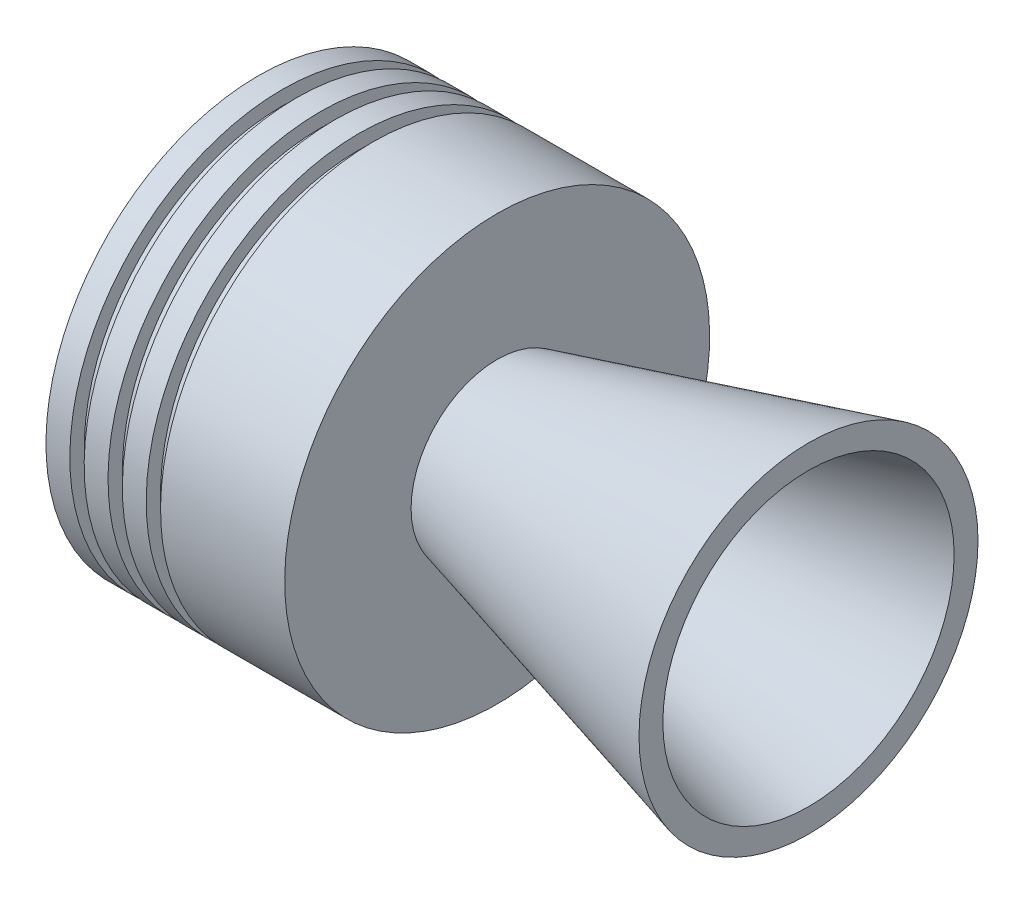
ISO-10303-21;
HEADER;
FILE_DESCRIPTION(('STEP AP214'),'2;1');
FILE_NAME('part.step','',(''),(''),'','','');
FILE_SCHEMA(('AUTOMOTIVE_DESIGN { 1 0 10303 214 1 1 1 1 }'));
ENDSEC;
DATA;
#1=APPLICATION_CONTEXT('core data for automotive mechanical design processes');
#2=APPLICATION_PROTOCOL_DEFINITION('international standard','automotive_design',2000,#1);
#3=PRODUCT_CONTEXT('',#1,'mechanical');
#4=PRODUCT('Part','Part','',(#3));
#5=PRODUCT_RELATED_PRODUCT_CATEGORY('part','',(#4));
#6=PRODUCT_DEFINITION_FORMATION('','',#4);
#7=PRODUCT_DEFINITION_CONTEXT('part definition',#1,'design');
#8=PRODUCT_DEFINITION('design','',#6,#7);
#9=PRODUCT_DEFINITION_SHAPE('','',#8);
#10=(LENGTH_UNIT() NAMED_UNIT(*) SI_UNIT(.MILLI.,.METRE.));
#11=(NAMED_UNIT(*) PLANE_ANGLE_UNIT() SI_UNIT($,.RADIAN.));
#12=(NAMED_UNIT(*) SI_UNIT($,.STERADIAN.) SOLID_ANGLE_UNIT());
#13=UNCERTAINTY_MEASURE_WITH_UNIT(LENGTH_MEASURE(1.E-05),#10,'distance_accuracy_value','');
#14=(GEOMETRIC_REPRESENTATION_CONTEXT(3) GLOBAL_UNCERTAINTY_ASSIGNED_CONTEXT((#13)) GLOBAL_UNIT_ASSIGNED_CONTEXT((#10,
#11,#12)) REPRESENTATION_CONTEXT('',''));
#15=CARTESIAN_POINT('',(0.,0.,0.));
#16=DIRECTION('',(0.,0.,1.));
#17=DIRECTION('',(1.,0.,0.));
#18=AXIS2_PLACEMENT_3D('',#15,#16,#17);
#19=CARTESIAN_POINT('',(0.,0.,0.));
#20=DIRECTION('',(1.,0.,0.));
#21=DIRECTION('',(0.,1.,0.));
#22=AXIS2_PLACEMENT_3D('',#19,#20,#21);
#23=CYLINDRICAL_SURFACE('',#22,11.5);
#24=CARTESIAN_POINT('',(-82.1051177665174,0.,0.));
#25=DIRECTION('',(1.,0.,0.));
#26=DIRECTION('',(0.,1.,0.));
#27=AXIS2_PLACEMENT_3D('',#24,#25,#26);
#28=CIRCLE('',#27,11.5);
#29=CARTESIAN_POINT('',(-82.1051177665174,11.5,0.));
#30=VERTEX_POINT('',#29);
#31=EDGE_CURVE('E112',#30,#30,#28,.T.);
#32=ORIENTED_EDGE('',*,*,#31,.T.);
#33=EDGE_LOOP('',(#32));
#34=FACE_BOUND('',#33,.T.);
#35=CARTESIAN_POINT('',(-83.1051177665174,0.,0.));
#36=DIRECTION('',(1.,0.,0.));
#37=DIRECTION('',(0.,1.,0.));
#38=AXIS2_PLACEMENT_3D('',#35,#36,#37);
#39=CIRCLE('',#38,11.5);
#40=CARTESIAN_POINT('',(-83.1051177665174,11.5,0.));
#41=VERTEX_POINT('',#40);
#42=EDGE_CURVE('E10',#41,#41,#39,.T.);
#43=ORIENTED_EDGE('',*,*,#42,.F.);
#44=EDGE_LOOP('',(#43));
#45=FACE_BOUND('',#44,.T.);
#46=ADVANCED_FACE('F36',(#34,#45),#23,.F.);
#47=CARTESIAN_POINT('',(-126.4,0.,0.));
#48=DIRECTION('',(-1.,0.,0.));
#49=DIRECTION('',(0.,-1.,0.));
#50=AXIS2_PLACEMENT_3D('',#47,#48,#49);
#51=CONICAL_SURFACE('',#50,36.4963119120344,0.5235987755983);
#52=ORIENTED_EDGE('',*,*,#42,.T.);
#53=EDGE_LOOP('',(#52));
#54=FACE_BOUND('',#53,.T.);
#55=CARTESIAN_POINT('',(-126.4,0.,0.));
#56=DIRECTION('',(1.,0.,0.));
#57=DIRECTION('',(0.,1.,0.));
#58=AXIS2_PLACEMENT_3D('',#55,#56,#57);
#59=CIRCLE('',#58,36.4963119120344);
#60=CARTESIAN_POINT('',(-126.4,36.4963119120344,0.));
#61=VERTEX_POINT('',#60);
#62=EDGE_CURVE('E44',#61,#61,#59,.T.);
#63=ORIENTED_EDGE('',*,*,#62,.F.);
#64=EDGE_LOOP('',(#63));
#65=FACE_BOUND('',#64,.T.);
#66=ADVANCED_FACE('F138',(#54,#65),#51,.F.);
#67=CARTESIAN_POINT('',(-126.4,36.4963119120344,0.));
#68=DIRECTION('',(-1.,0.,0.));
#69=DIRECTION('',(0.,-1.,0.));
#70=AXIS2_PLACEMENT_3D('',#67,#68,#69);
#71=PLANE('',#70);
#72=ORIENTED_EDGE('',*,*,#62,.T.);
#73=EDGE_LOOP('',(#72));
#74=FACE_BOUND('',#73,.T.);
#75=CARTESIAN_POINT('',(-126.4,0.,0.));
#76=DIRECTION('',(1.,0.,0.));
#77=DIRECTION('',(0.,1.,0.));
#78=AXIS2_PLACEMENT_3D('',#75,#76,#77);
#79=CIRCLE('',#78,44.4963119120344);
#80=CARTESIAN_POINT('',(-126.4,44.4963119120344,0.));
#81=VERTEX_POINT('',#80);
#82=EDGE_CURVE('E50',#81,#81,#79,.T.);
#83=ORIENTED_EDGE('',*,*,#82,.F.);
#84=EDGE_LOOP('',(#83));
#85=FACE_BOUND('',#84,.T.);
#86=ADVANCED_FACE('F142',(#74,#85),#71,.T.);
#87=CARTESIAN_POINT('',(0.,0.,0.));
#88=DIRECTION('',(1.,0.,0.));
#89=DIRECTION('',(0.,1.,0.));
#90=AXIS2_PLACEMENT_3D('',#87,#88,#89);
#91=CYLINDRICAL_SURFACE('',#90,44.4963119120344);
#92=ORIENTED_EDGE('',*,*,#82,.T.);
#93=EDGE_LOOP('',(#92));
#94=FACE_BOUND('',#93,.T.);
#95=CARTESIAN_POINT('',(-121.4,0.,0.));
#96=DIRECTION('',(1.,0.,0.));
#97=DIRECTION('',(0.,1.,0.));
#98=AXIS2_PLACEMENT_3D('',#95,#96,#97);
#99=CIRCLE('',#98,44.4963119120344);
#100=CARTESIAN_POINT('',(-121.4,44.4963119120344,0.));
#101=VERTEX_POINT('',#100);
#102=EDGE_CURVE('E56',#101,#101,#99,.T.);
#103=ORIENTED_EDGE('',*,*,#102,.F.);
#104=EDGE_LOOP('',(#103));
#105=FACE_BOUND('',#104,.T.);
#106=ADVANCED_FACE('F146',(#94,#105),#91,.T.);
#107=CARTESIAN_POINT('',(-121.4,44.4963119120344,0.));
#108=DIRECTION('',(1.,0.,0.));
#109=DIRECTION('',(0.,1.,0.));
#110=AXIS2_PLACEMENT_3D('',#107,#108,#109);
#111=PLANE('',#110);
#112=ORIENTED_EDGE('',*,*,#102,.T.);
#113=EDGE_LOOP('',(#112));
#114=FACE_BOUND('',#113,.T.);
#115=CARTESIAN_POINT('',(-121.4,0.,0.));
#116=DIRECTION('',(1.,0.,0.));
#117=DIRECTION('',(0.,1.,0.));
#118=AXIS2_PLACEMENT_3D('',#115,#116,#117);
#119=CIRCLE('',#118,41.4963119120344);
#120=CARTESIAN_POINT('',(-121.4,41.4963119120344,0.));
#121=VERTEX_POINT('',#120);
#122=EDGE_CURVE('E60',#121,#121,#119,.T.);
#123=ORIENTED_EDGE('',*,*,#122,.F.);
#124=EDGE_LOOP('',(#123));
#125=FACE_BOUND('',#124,.T.);
#126=ADVANCED_FACE('F153',(#114,#125),#111,.T.);
#127=CARTESIAN_POINT('',(0.,0.,0.));
#128=DIRECTION('',(1.,0.,0.));
#129=DIRECTION('',(0.,1.,0.));
#130=AXIS2_PLACEMENT_3D('',#127,#128,#129);
#131=CYLINDRICAL_SURFACE('',#130,41.4963119120344);
#132=ORIENTED_EDGE('',*,*,#122,.T.);
#133=EDGE_LOOP('',(#132));
#134=FACE_BOUND('',#133,.T.);
#135=CARTESIAN_POINT('',(-118.4,0.,0.));
#136=DIRECTION('',(1.,0.,0.));
#137=DIRECTION('',(0.,1.,0.));
#138=AXIS2_PLACEMENT_3D('',#135,#136,#137);
#139=CIRCLE('',#138,41.4963119120344);
#140=CARTESIAN_POINT('',(-118.4,41.4963119120344,0.));
#141=VERTEX_POINT('',#140);
#142=EDGE_CURVE('E64',#141,#141,#139,.T.);
#143=ORIENTED_EDGE('',*,*,#142,.F.);
#144=EDGE_LOOP('',(#143));
#145=FACE_BOUND('',#144,.T.);
#146=ADVANCED_FACE('F157',(#134,#145),#131,.T.);
#147=CARTESIAN_POINT('',(-118.4,41.4963119120344,0.));
#148=DIRECTION('',(-1.,0.,0.));
#149=DIRECTION('',(0.,-1.,0.));
#150=AXIS2_PLACEMENT_3D('',#147,#148,#149);
#151=PLANE('',#150);
#152=ORIENTED_EDGE('',*,*,#142,.T.);
#153=EDGE_LOOP('',(#152));
#154=FACE_BOUND('',#153,.T.);
#155=CARTESIAN_POINT('',(-118.4,0.,0.));
#156=DIRECTION('',(1.,0.,0.));
#157=DIRECTION('',(0.,1.,0.));
#158=AXIS2_PLACEMENT_3D('',#155,#156,#157);
#159=CIRCLE('',#158,44.4963119120344);
#160=CARTESIAN_POINT('',(-118.4,44.4963119120344,0.));
#161=VERTEX_POINT('',#160);
#162=EDGE_CURVE('E68',#161,#161,#159,.T.);
#163=ORIENTED_EDGE('',*,*,#162,.F.);
#164=EDGE_LOOP('',(#163));
#165=FACE_BOUND('',#164,.T.);
#166=ADVANCED_FACE('F161',(#154,#165),#151,.T.);
#167=CARTESIAN_POINT('',(0.,0.,0.));
#168=DIRECTION('',(1.,0.,0.));
#169=DIRECTION('',(0.,1.,0.));
#170=AXIS2_PLACEMENT_3D('',#167,#168,#169);
#171=CYLINDRICAL_SURFACE('',#170,44.4963119120344);
#172=ORIENTED_EDGE('',*,*,#162,.T.);
#173=EDGE_LOOP('',(#172));
#174=FACE_BOUND('',#173,.T.);
#175=CARTESIAN_POINT('',(-113.4,0.,0.));
#176=DIRECTION('',(1.,0.,0.));
#177=DIRECTION('',(0.,1.,0.));
#178=AXIS2_PLACEMENT_3D('',#175,#176,#177);
#179=CIRCLE('',#178,44.4963119120344);
#180=CARTESIAN_POINT('',(-113.4,44.4963119120344,0.));
#181=VERTEX_POINT('',#180);
#182=EDGE_CURVE('E72',#181,#181,#179,.T.);
#183=ORIENTED_EDGE('',*,*,#182,.F.);
#184=EDGE_LOOP('',(#183));
#185=FACE_BOUND('',#184,.T.);
#186=ADVANCED_FACE('F165',(#174,#185),#171,.T.);
#187=CARTESIAN_POINT('',(-113.4,44.4963119120344,0.));
#188=DIRECTION('',(1.,0.,0.));
#189=DIRECTION('',(0.,1.,0.));
#190=AXIS2_PLACEMENT_3D('',#187,#188,#189);
#191=PLANE('',#190);
#192=ORIENTED_EDGE('',*,*,#182,.T.);
#193=EDGE_LOOP('',(#192));
#194=FACE_BOUND('',#193,.T.);
#195=CARTESIAN_POINT('',(-113.4,0.,0.));
#196=DIRECTION('',(1.,0.,0.));
#197=DIRECTION('',(0.,1.,0.));
#198=AXIS2_PLACEMENT_3D('',#195,#196,#197);
#199=CIRCLE('',#198,41.4963119120344);
#200=CARTESIAN_POINT('',(-113.4,41.4963119120344,0.));
#201=VERTEX_POINT('',#200);
#202=EDGE_CURVE('E76',#201,#201,#199,.T.);
#203=ORIENTED_EDGE('',*,*,#202,.F.);
#204=EDGE_LOOP('',(#203));
#205=FACE_BOUND('',#204,.T.);
#206=ADVANCED_FACE('F169',(#194,#205),#191,.T.);
#207=CARTESIAN_POINT('',(0.,0.,0.));
#208=DIRECTION('',(1.,0.,0.));
#209=DIRECTION('',(0.,1.,0.));
#210=AXIS2_PLACEMENT_3D('',#207,#208,#209);
#211=CYLINDRICAL_SURFACE('',#210,41.4963119120344);
#212=ORIENTED_EDGE('',*,*,#202,.T.);
#213=EDGE_LOOP('',(#212));
#214=FACE_BOUND('',#213,.T.);
#215=CARTESIAN_POINT('',(-110.4,0.,0.));
#216=DIRECTION('',(1.,0.,0.));
#217=DIRECTION('',(0.,1.,0.));
#218=AXIS2_PLACEMENT_3D('',#215,#216,#217);
#219=CIRCLE('',#218,41.4963119120344);
#220=CARTESIAN_POINT('',(-110.4,41.4963119120344,0.));
#221=VERTEX_POINT('',#220);
#222=EDGE_CURVE('E80',#221,#221,#219,.T.);
#223=ORIENTED_EDGE('',*,*,#222,.F.);
#224=EDGE_LOOP('',(#223));
#225=FACE_BOUND('',#224,.T.);
#226=ADVANCED_FACE('F173',(#214,#225),#211,.T.);
#227=CARTESIAN_POINT('',(-110.4,41.4963119120344,0.));
#228=DIRECTION('',(-1.,0.,0.));
#229=DIRECTION('',(0.,-1.,0.));
#230=AXIS2_PLACEMENT_3D('',#227,#228,#229);
#231=PLANE('',#230);
#232=ORIENTED_EDGE('',*,*,#222,.T.);
#233=EDGE_LOOP('',(#232));
#234=FACE_BOUND('',#233,.T.);
#235=CARTESIAN_POINT('',(-110.4,0.,0.));
#236=DIRECTION('',(1.,0.,0.));
#237=DIRECTION('',(0.,1.,0.));
#238=AXIS2_PLACEMENT_3D('',#235,#236,#237);
#239=CIRCLE('',#238,44.4963119120344);
#240=CARTESIAN_POINT('',(-110.4,44.4963119120344,0.));
#241=VERTEX_POINT('',#240);
#242=EDGE_CURVE('E84',#241,#241,#239,.T.);
#243=ORIENTED_EDGE('',*,*,#242,.F.);
#244=EDGE_LOOP('',(#243));
#245=FACE_BOUND('',#244,.T.);
#246=ADVANCED_FACE('F177',(#234,#245),#231,.T.);
#247=CARTESIAN_POINT('',(0.,0.,0.));
#248=DIRECTION('',(1.,0.,0.));
#249=DIRECTION('',(0.,1.,0.));
#250=AXIS2_PLACEMENT_3D('',#247,#248,#249);
#251=CYLINDRICAL_SURFACE('',#250,44.4963119120344);
#252=ORIENTED_EDGE('',*,*,#242,.T.);
#253=EDGE_LOOP('',(#252));
#254=FACE_BOUND('',#253,.T.);
#255=CARTESIAN_POINT('',(-105.4,0.,0.));
#256=DIRECTION('',(1.,0.,0.));
#257=DIRECTION('',(0.,1.,0.));
#258=AXIS2_PLACEMENT_3D('',#255,#256,#257);
#259=CIRCLE('',#258,44.4963119120344);
#260=CARTESIAN_POINT('',(-105.4,44.4963119120344,0.));
#261=VERTEX_POINT('',#260);
#262=EDGE_CURVE('E88',#261,#261,#259,.T.);
#263=ORIENTED_EDGE('',*,*,#262,.F.);
#264=EDGE_LOOP('',(#263));
#265=FACE_BOUND('',#264,.T.);
#266=ADVANCED_FACE('F181',(#254,#265),#251,.T.);
#267=CARTESIAN_POINT('',(-105.4,44.4963119120344,0.));
#268=DIRECTION('',(1.,0.,0.));
#269=DIRECTION('',(0.,1.,0.));
#270=AXIS2_PLACEMENT_3D('',#267,#268,#269);
#271=PLANE('',#270);
#272=ORIENTED_EDGE('',*,*,#262,.T.);
#273=EDGE_LOOP('',(#272));
#274=FACE_BOUND('',#273,.T.);
#275=CARTESIAN_POINT('',(-105.4,0.,0.));
#276=DIRECTION('',(1.,0.,0.));
#277=DIRECTION('',(0.,1.,0.));
#278=AXIS2_PLACEMENT_3D('',#275,#276,#277);
#279=CIRCLE('',#278,41.4963119120344);
#280=CARTESIAN_POINT('',(-105.4,41.4963119120344,0.));
#281=VERTEX_POINT('',#280);
#282=EDGE_CURVE('E92',#281,#281,#279,.T.);
#283=ORIENTED_EDGE('',*,*,#282,.F.);
#284=EDGE_LOOP('',(#283));
#285=FACE_BOUND('',#284,.T.);
#286=ADVANCED_FACE('F185',(#274,#285),#271,.T.);
#287=CARTESIAN_POINT('',(0.,0.,0.));
#288=DIRECTION('',(1.,0.,0.));
#289=DIRECTION('',(0.,1.,0.));
#290=AXIS2_PLACEMENT_3D('',#287,#288,#289);
#291=CYLINDRICAL_SURFACE('',#290,41.4963119120344);
#292=ORIENTED_EDGE('',*,*,#282,.T.);
#293=EDGE_LOOP('',(#292));
#294=FACE_BOUND('',#293,.T.);
#295=CARTESIAN_POINT('',(-102.4,0.,0.));
#296=DIRECTION('',(1.,0.,0.));
#297=DIRECTION('',(0.,1.,0.));
#298=AXIS2_PLACEMENT_3D('',#295,#296,#297);
#299=CIRCLE('',#298,41.4963119120344);
#300=CARTESIAN_POINT('',(-102.4,41.4963119120344,0.));
#301=VERTEX_POINT('',#300);
#302=EDGE_CURVE('E96',#301,#301,#299,.T.);
#303=ORIENTED_EDGE('',*,*,#302,.F.);
#304=EDGE_LOOP('',(#303));
#305=FACE_BOUND('',#304,.T.);
#306=ADVANCED_FACE('F189',(#294,#305),#291,.T.);
#307=CARTESIAN_POINT('',(-102.4,41.4963119120344,0.));
#308=DIRECTION('',(-1.,0.,0.));
#309=DIRECTION('',(0.,-1.,0.));
#310=AXIS2_PLACEMENT_3D('',#307,#308,#309);
#311=PLANE('',#310);
#312=ORIENTED_EDGE('',*,*,#302,.T.);
#313=EDGE_LOOP('',(#312));
#314=FACE_BOUND('',#313,.T.);
#315=CARTESIAN_POINT('',(-102.4,0.,0.));
#316=DIRECTION('',(1.,0.,0.));
#317=DIRECTION('',(0.,1.,0.));
#318=AXIS2_PLACEMENT_3D('',#315,#316,#317);
#319=CIRCLE('',#318,44.4963119120344);
#320=CARTESIAN_POINT('',(-102.4,44.4963119120344,0.));
#321=VERTEX_POINT('',#320);
#322=EDGE_CURVE('E100',#321,#321,#319,.T.);
#323=ORIENTED_EDGE('',*,*,#322,.F.);
#324=EDGE_LOOP('',(#323));
#325=FACE_BOUND('',#324,.T.);
#326=ADVANCED_FACE('F193',(#314,#325),#311,.T.);
#327=CARTESIAN_POINT('',(0.,0.,0.));
#328=DIRECTION('',(1.,0.,0.));
#329=DIRECTION('',(0.,1.,0.));
#330=AXIS2_PLACEMENT_3D('',#327,#328,#329);
#331=CYLINDRICAL_SURFACE('',#330,44.4963119120344);
#332=ORIENTED_EDGE('',*,*,#322,.T.);
#333=EDGE_LOOP('',(#332));
#334=FACE_BOUND('',#333,.T.);
#335=CARTESIAN_POINT('',(-76.4,0.,0.));
#336=DIRECTION('',(1.,0.,0.));
#337=DIRECTION('',(0.,1.,0.));
#338=AXIS2_PLACEMENT_3D('',#335,#336,#337);
#339=CIRCLE('',#338,44.4963119120344);
#340=CARTESIAN_POINT('',(-76.4,44.4963119120344,0.));
#341=VERTEX_POINT('',#340);
#342=EDGE_CURVE('E104',#341,#341,#339,.T.);
#343=ORIENTED_EDGE('',*,*,#342,.F.);
#344=EDGE_LOOP('',(#343));
#345=FACE_BOUND('',#344,.T.);
#346=ADVANCED_FACE('F197',(#334,#345),#331,.T.);
#347=CARTESIAN_POINT('',(-76.4,44.4963119120344,0.));
#348=DIRECTION('',(1.,0.,0.));
#349=DIRECTION('',(0.,1.,0.));
#350=AXIS2_PLACEMENT_3D('',#347,#348,#349);
#351=PLANE('',#350);
#352=ORIENTED_EDGE('',*,*,#342,.T.);
#353=EDGE_LOOP('',(#352));
#354=FACE_BOUND('',#353,.T.);
#355=CARTESIAN_POINT('',(-76.4,0.,0.));
#356=DIRECTION('',(1.,0.,0.));
#357=DIRECTION('',(0.,1.,0.));
#358=AXIS2_PLACEMENT_3D('',#355,#356,#357);
#359=CIRCLE('',#358,18.0286816982628);
#360=CARTESIAN_POINT('',(-76.4,18.0286816982628,0.));
#361=VERTEX_POINT('',#360);
#362=EDGE_CURVE('E108',#361,#361,#359,.T.);
#363=ORIENTED_EDGE('',*,*,#362,.F.);
#364=EDGE_LOOP('',(#363));
#365=FACE_BOUND('',#364,.T.);
#366=ADVANCED_FACE('F201',(#354,#365),#351,.T.);
#367=CARTESIAN_POINT('',(0.,0.,0.));
#368=DIRECTION('',(1.,0.,0.));
#369=DIRECTION('',(0.,1.,0.));
#370=AXIS2_PLACEMENT_3D('',#367,#368,#369);
#371=CONICAL_SURFACE('',#370,38.5,0.261799387799143);
#372=CARTESIAN_POINT('',(-11.1961524227069,0.,0.));
#373=DIRECTION('',(-1.,0.,0.));
#374=DIRECTION('',(0.,-1.,0.));
#375=AXIS2_PLACEMENT_3D('',#372,#373,#374);
#376=CIRCLE('',#375,35.5);
#377=CARTESIAN_POINT('',(-11.1961524227069,-35.5,0.));
#378=VERTEX_POINT('',#377);
#379=EDGE_CURVE('E116',#378,#378,#376,.F.);
#380=ORIENTED_EDGE('',*,*,#379,.F.);
#381=EDGE_LOOP('',(#380));
#382=FACE_BOUND('',#381,.T.);
#383=ORIENTED_EDGE('',*,*,#362,.T.);
#384=EDGE_LOOP('',(#383));
#385=FACE_BOUND('',#384,.T.);
#386=ADVANCED_FACE('F132',(#382,#385),#371,.T.);
#387=CARTESIAN_POINT('',(-82.1051177665174,0.,0.));
#388=DIRECTION('',(1.,0.,0.));
#389=DIRECTION('',(0.,1.,0.));
#390=AXIS2_PLACEMENT_3D('',#387,#388,#389);
#391=CONICAL_SURFACE('',#390,11.5,0.261799387799143);
#392=CARTESIAN_POINT('',(-11.1961524227069,0.,0.));
#393=DIRECTION('',(-1.,0.,0.));
#394=DIRECTION('',(0.,-1.,0.));
#395=AXIS2_PLACEMENT_3D('',#392,#393,#394);
#396=CIRCLE('',#395,30.5);
#397=CARTESIAN_POINT('',(-11.1961524227069,-30.5,0.));
#398=VERTEX_POINT('',#397);
#399=EDGE_CURVE('E39',#398,#398,#396,.T.);
#400=ORIENTED_EDGE('',*,*,#399,.F.);
#401=EDGE_LOOP('',(#400));
#402=FACE_BOUND('',#401,.T.);
#403=ORIENTED_EDGE('',*,*,#31,.F.);
#404=EDGE_LOOP('',(#403));
#405=FACE_BOUND('',#404,.T.);
#406=ADVANCED_FACE('F129',(#402,#405),#391,.F.);
#407=CARTESIAN_POINT('',(-11.1961524227069,35.5,0.));
#408=DIRECTION('',(-1.,0.,0.));
#409=DIRECTION('',(0.,-1.,0.));
#410=AXIS2_PLACEMENT_3D('',#407,#408,#409);
#411=PLANE('',#410);
#412=ORIENTED_EDGE('',*,*,#379,.T.);
#413=EDGE_LOOP('',(#412));
#414=FACE_BOUND('',#413,.T.);
#415=ORIENTED_EDGE('',*,*,#399,.T.);
#416=EDGE_LOOP('',(#415));
#417=FACE_BOUND('',#416,.T.);
#418=ADVANCED_FACE('F127',(#414,#417),#411,.F.);
#419=CLOSED_SHELL('',(#46,#66,#86,#106,#126,#146,#166,#186,#206,#226,#246,#266,#286,#306,#326,
#346,#366,#386,#406,#418));
#420=MANIFOLD_SOLID_BREP('B2',#419);
#421=ADVANCED_BREP_SHAPE_REPRESENTATION('',(#18,#420),#14);
#422=SHAPE_DEFINITION_REPRESENTATION(#9,#421);
ENDSEC;
END-ISO-10303-21;
